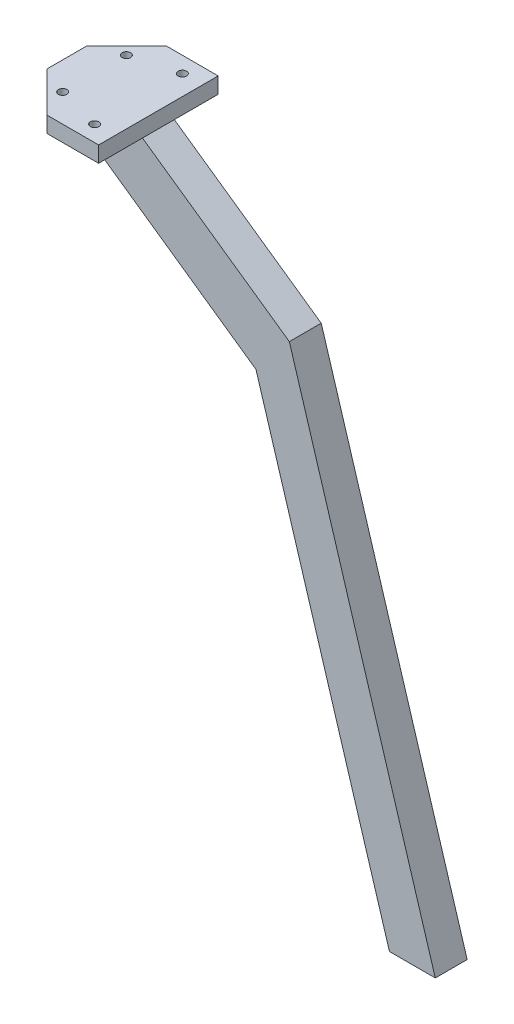
ISO-10303-21;
HEADER;
FILE_DESCRIPTION(('STEP AP214'),'2;1');
FILE_NAME('part.step','',(''),(''),'','','');
FILE_SCHEMA(('AUTOMOTIVE_DESIGN { 1 0 10303 214 1 1 1 1 }'));
ENDSEC;
DATA;
#1=APPLICATION_CONTEXT('core data for automotive mechanical design processes');
#2=APPLICATION_PROTOCOL_DEFINITION('international standard','automotive_design',2000,#1);
#3=PRODUCT_CONTEXT('',#1,'mechanical');
#4=PRODUCT('Part','Part','',(#3));
#5=PRODUCT_RELATED_PRODUCT_CATEGORY('part','',(#4));
#6=PRODUCT_DEFINITION_FORMATION('','',#4);
#7=PRODUCT_DEFINITION_CONTEXT('part definition',#1,'design');
#8=PRODUCT_DEFINITION('design','',#6,#7);
#9=PRODUCT_DEFINITION_SHAPE('','',#8);
#10=(LENGTH_UNIT() NAMED_UNIT(*) SI_UNIT(.MILLI.,.METRE.));
#11=(NAMED_UNIT(*) PLANE_ANGLE_UNIT() SI_UNIT($,.RADIAN.));
#12=(NAMED_UNIT(*) SI_UNIT($,.STERADIAN.) SOLID_ANGLE_UNIT());
#13=UNCERTAINTY_MEASURE_WITH_UNIT(LENGTH_MEASURE(1.E-05),#10,'distance_accuracy_value','');
#14=(GEOMETRIC_REPRESENTATION_CONTEXT(3) GLOBAL_UNCERTAINTY_ASSIGNED_CONTEXT((#13)) GLOBAL_UNIT_ASSIGNED_CONTEXT((#10,
#11,#12)) REPRESENTATION_CONTEXT('',''));
#15=CARTESIAN_POINT('',(0.,0.,0.));
#16=DIRECTION('',(0.,0.,1.));
#17=DIRECTION('',(1.,0.,0.));
#18=AXIS2_PLACEMENT_3D('',#15,#16,#17);
#19=CARTESIAN_POINT('',(0.,0.,0.));
#20=DIRECTION('',(0.,-1.,0.));
#21=DIRECTION('',(0.,0.,-1.));
#22=AXIS2_PLACEMENT_3D('',#19,#20,#21);
#23=PLANE('',#22);
#24=CARTESIAN_POINT('',(6.96945989785264,0.,-23.));
#25=DIRECTION('',(0.,1.,0.));
#26=DIRECTION('',(0.,0.,1.));
#27=AXIS2_PLACEMENT_3D('',#24,#25,#26);
#28=CIRCLE('',#27,1.06398593230415);
#29=CARTESIAN_POINT('',(6.96945989785264,0.,-21.9360140676959));
#30=VERTEX_POINT('',#29);
#31=EDGE_CURVE('E185',#30,#30,#28,.T.);
#32=ORIENTED_EDGE('',*,*,#31,.T.);
#33=EDGE_LOOP('',(#32));
#34=FACE_BOUND('',#33,.T.);
#35=CARTESIAN_POINT('',(18.,0.,-26.));
#36=DIRECTION('',(0.,1.,0.));
#37=DIRECTION('',(0.,0.,1.));
#38=AXIS2_PLACEMENT_3D('',#35,#36,#37);
#39=CIRCLE('',#38,1.06398593230415);
#40=CARTESIAN_POINT('',(18.,0.,-24.9360140676959));
#41=VERTEX_POINT('',#40);
#42=EDGE_CURVE('E184',#41,#41,#39,.T.);
#43=ORIENTED_EDGE('',*,*,#42,.T.);
#44=EDGE_LOOP('',(#43));
#45=FACE_BOUND('',#44,.T.);
#46=DIRECTION('',(0.,0.,-1.));
#47=VECTOR('',#46,1.);
#48=CARTESIAN_POINT('',(23.,0.,0.));
#49=LINE('',#48,#47);
#50=CARTESIAN_POINT('',(23.,0.,-19.));
#51=VERTEX_POINT('',#50);
#52=CARTESIAN_POINT('',(23.,0.,-30.));
#53=VERTEX_POINT('',#52);
#54=EDGE_CURVE('E142',#51,#53,#49,.T.);
#55=ORIENTED_EDGE('',*,*,#54,.F.);
#56=DIRECTION('',(-1.,0.,0.));
#57=VECTOR('',#56,1.);
#58=CARTESIAN_POINT('',(0.,0.,-19.));
#59=LINE('',#58,#57);
#60=CARTESIAN_POINT('',(0.,0.,-19.));
#61=VERTEX_POINT('',#60);
#62=EDGE_CURVE('E163',#51,#61,#59,.T.);
#63=ORIENTED_EDGE('',*,*,#62,.T.);
#64=DIRECTION('',(0.,0.,1.));
#65=VECTOR('',#64,1.);
#66=CARTESIAN_POINT('',(0.,0.,-10.));
#67=LINE('',#66,#65);
#68=CARTESIAN_POINT('',(0.,0.,-20.));
#69=VERTEX_POINT('',#68);
#70=EDGE_CURVE('E146',#69,#61,#67,.T.);
#71=ORIENTED_EDGE('',*,*,#70,.F.);
#72=DIRECTION('',(-0.707106781186547,0.,0.707106781186548));
#73=VECTOR('',#72,1.);
#74=CARTESIAN_POINT('',(0.,0.,-20.));
#75=LINE('',#74,#73);
#76=CARTESIAN_POINT('',(10.,0.,-30.));
#77=VERTEX_POINT('',#76);
#78=EDGE_CURVE('E144',#77,#69,#75,.T.);
#79=ORIENTED_EDGE('',*,*,#78,.F.);
#80=DIRECTION('',(-1.,0.,0.));
#81=VECTOR('',#80,1.);
#82=CARTESIAN_POINT('',(10.,0.,-30.));
#83=LINE('',#82,#81);
#84=EDGE_CURVE('E141',#53,#77,#83,.T.);
#85=ORIENTED_EDGE('',*,*,#84,.F.);
#86=EDGE_LOOP('',(#55,#63,#71,#79,#85));
#87=FACE_BOUND('',#86,.T.);
#88=ADVANCED_FACE('F39',(#34,#45,#87),#23,.T.);
#89=CARTESIAN_POINT('',(0.,4.,0.));
#90=DIRECTION('',(0.,-1.,0.));
#91=DIRECTION('',(0.,0.,-1.));
#92=AXIS2_PLACEMENT_3D('',#89,#90,#91);
#93=PLANE('',#92);
#94=DIRECTION('',(0.,0.,-1.));
#95=VECTOR('',#94,1.);
#96=CARTESIAN_POINT('',(23.,4.,0.));
#97=LINE('',#96,#95);
#98=CARTESIAN_POINT('',(23.,4.,0.));
#99=VERTEX_POINT('',#98);
#100=CARTESIAN_POINT('',(23.,4.,-30.));
#101=VERTEX_POINT('',#100);
#102=EDGE_CURVE('E151',#99,#101,#97,.T.);
#103=ORIENTED_EDGE('',*,*,#102,.T.);
#104=DIRECTION('',(-1.,0.,0.));
#105=VECTOR('',#104,1.);
#106=CARTESIAN_POINT('',(10.,4.,-30.));
#107=LINE('',#106,#105);
#108=CARTESIAN_POINT('',(10.,4.,-30.));
#109=VERTEX_POINT('',#108);
#110=EDGE_CURVE('E98',#101,#109,#107,.T.);
#111=ORIENTED_EDGE('',*,*,#110,.T.);
#112=DIRECTION('',(-0.707106781186547,0.,0.707106781186548));
#113=VECTOR('',#112,1.);
#114=CARTESIAN_POINT('',(0.,4.,-20.));
#115=LINE('',#114,#113);
#116=CARTESIAN_POINT('',(0.,4.,-20.));
#117=VERTEX_POINT('',#116);
#118=EDGE_CURVE('E115',#109,#117,#115,.T.);
#119=ORIENTED_EDGE('',*,*,#118,.T.);
#120=DIRECTION('',(0.,0.,1.));
#121=VECTOR('',#120,1.);
#122=CARTESIAN_POINT('',(0.,4.,-10.));
#123=LINE('',#122,#121);
#124=CARTESIAN_POINT('',(0.,4.,-10.));
#125=VERTEX_POINT('',#124);
#126=EDGE_CURVE('E107',#117,#125,#123,.T.);
#127=ORIENTED_EDGE('',*,*,#126,.T.);
#128=DIRECTION('',(0.707106781186548,0.,0.707106781186547));
#129=VECTOR('',#128,1.);
#130=CARTESIAN_POINT('',(10.,4.,0.));
#131=LINE('',#130,#129);
#132=CARTESIAN_POINT('',(10.,4.,0.));
#133=VERTEX_POINT('',#132);
#134=EDGE_CURVE('E112',#125,#133,#131,.T.);
#135=ORIENTED_EDGE('',*,*,#134,.T.);
#136=DIRECTION('',(1.,0.,0.));
#137=VECTOR('',#136,1.);
#138=CARTESIAN_POINT('',(10.,4.,0.));
#139=LINE('',#138,#137);
#140=EDGE_CURVE('E63',#133,#99,#139,.T.);
#141=ORIENTED_EDGE('',*,*,#140,.T.);
#142=EDGE_LOOP('',(#103,#111,#119,#127,#135,#141));
#143=FACE_BOUND('',#142,.T.);
#144=CARTESIAN_POINT('',(6.96945989785264,4.,-7.));
#145=DIRECTION('',(0.,1.,0.));
#146=DIRECTION('',(0.,0.,1.));
#147=AXIS2_PLACEMENT_3D('',#144,#145,#146);
#148=CIRCLE('',#147,1.06398593230415);
#149=CARTESIAN_POINT('',(6.96945989785264,4.,-5.93601406769585));
#150=VERTEX_POINT('',#149);
#151=EDGE_CURVE('E201',#150,#150,#148,.T.);
#152=ORIENTED_EDGE('',*,*,#151,.F.);
#153=EDGE_LOOP('',(#152));
#154=FACE_BOUND('',#153,.T.);
#155=CARTESIAN_POINT('',(18.,4.,-4.));
#156=DIRECTION('',(0.,1.,0.));
#157=DIRECTION('',(0.,0.,1.));
#158=AXIS2_PLACEMENT_3D('',#155,#156,#157);
#159=CIRCLE('',#158,1.06398593230415);
#160=CARTESIAN_POINT('',(18.,4.,-2.93601406769585));
#161=VERTEX_POINT('',#160);
#162=EDGE_CURVE('E195',#161,#161,#159,.T.);
#163=ORIENTED_EDGE('',*,*,#162,.F.);
#164=EDGE_LOOP('',(#163));
#165=FACE_BOUND('',#164,.T.);
#166=CARTESIAN_POINT('',(18.,4.,-26.));
#167=DIRECTION('',(0.,1.,0.));
#168=DIRECTION('',(0.,0.,1.));
#169=AXIS2_PLACEMENT_3D('',#166,#167,#168);
#170=CIRCLE('',#169,1.06398593230415);
#171=CARTESIAN_POINT('',(18.,4.,-24.9360140676959));
#172=VERTEX_POINT('',#171);
#173=EDGE_CURVE('E189',#172,#172,#170,.T.);
#174=ORIENTED_EDGE('',*,*,#173,.F.);
#175=EDGE_LOOP('',(#174));
#176=FACE_BOUND('',#175,.T.);
#177=CARTESIAN_POINT('',(6.96945989785264,4.,-23.));
#178=DIRECTION('',(0.,1.,0.));
#179=DIRECTION('',(0.,0.,1.));
#180=AXIS2_PLACEMENT_3D('',#177,#178,#179);
#181=CIRCLE('',#180,1.06398593230415);
#182=CARTESIAN_POINT('',(6.96945989785264,4.,-21.9360140676959));
#183=VERTEX_POINT('',#182);
#184=EDGE_CURVE('E181',#183,#183,#181,.T.);
#185=ORIENTED_EDGE('',*,*,#184,.F.);
#186=EDGE_LOOP('',(#185));
#187=FACE_BOUND('',#186,.T.);
#188=ADVANCED_FACE('F109',(#143,#154,#165,#176,#187),#93,.F.);
#189=DIRECTION('',(-1.,0.,0.));
#190=VECTOR('',#189,1.);
#191=CARTESIAN_POINT('',(0.,0.,-11.));
#192=LINE('',#191,#190);
#193=CARTESIAN_POINT('',(23.,0.,-11.));
#194=VERTEX_POINT('',#193);
#195=CARTESIAN_POINT('',(0.,0.,-11.));
#196=VERTEX_POINT('',#195);
#197=EDGE_CURVE('E237',#194,#196,#192,.T.);
#198=ORIENTED_EDGE('',*,*,#197,.F.);
#199=CARTESIAN_POINT('',(23.,0.,0.));
#200=VERTEX_POINT('',#199);
#201=EDGE_CURVE('E138',#200,#194,#49,.T.);
#202=ORIENTED_EDGE('',*,*,#201,.F.);
#203=DIRECTION('',(1.,0.,0.));
#204=VECTOR('',#203,1.);
#205=CARTESIAN_POINT('',(10.,0.,0.));
#206=LINE('',#205,#204);
#207=CARTESIAN_POINT('',(10.,0.,0.));
#208=VERTEX_POINT('',#207);
#209=EDGE_CURVE('E90',#208,#200,#206,.T.);
#210=ORIENTED_EDGE('',*,*,#209,.F.);
#211=DIRECTION('',(0.707106781186548,0.,0.707106781186547));
#212=VECTOR('',#211,1.);
#213=CARTESIAN_POINT('',(10.,0.,0.));
#214=LINE('',#213,#212);
#215=CARTESIAN_POINT('',(0.,0.,-10.));
#216=VERTEX_POINT('',#215);
#217=EDGE_CURVE('E148',#216,#208,#214,.T.);
#218=ORIENTED_EDGE('',*,*,#217,.F.);
#219=EDGE_CURVE('E126',#196,#216,#67,.T.);
#220=ORIENTED_EDGE('',*,*,#219,.F.);
#221=EDGE_LOOP('',(#198,#202,#210,#218,#220));
#222=FACE_BOUND('',#221,.T.);
#223=CARTESIAN_POINT('',(6.96945989785264,0.,-7.));
#224=DIRECTION('',(0.,1.,0.));
#225=DIRECTION('',(0.,0.,1.));
#226=AXIS2_PLACEMENT_3D('',#223,#224,#225);
#227=CIRCLE('',#226,1.06398593230415);
#228=CARTESIAN_POINT('',(6.96945989785264,0.,-5.93601406769585));
#229=VERTEX_POINT('',#228);
#230=EDGE_CURVE('E198',#229,#229,#227,.T.);
#231=ORIENTED_EDGE('',*,*,#230,.T.);
#232=EDGE_LOOP('',(#231));
#233=FACE_BOUND('',#232,.T.);
#234=CARTESIAN_POINT('',(18.,0.,-4.));
#235=DIRECTION('',(0.,1.,0.));
#236=DIRECTION('',(0.,0.,1.));
#237=AXIS2_PLACEMENT_3D('',#234,#235,#236);
#238=CIRCLE('',#237,1.06398593230415);
#239=CARTESIAN_POINT('',(18.,0.,-2.93601406769585));
#240=VERTEX_POINT('',#239);
#241=EDGE_CURVE('E192',#240,#240,#238,.T.);
#242=ORIENTED_EDGE('',*,*,#241,.T.);
#243=EDGE_LOOP('',(#242));
#244=FACE_BOUND('',#243,.T.);
#245=ADVANCED_FACE('F218',(#222,#233,#244),#23,.T.);
#246=CARTESIAN_POINT('',(23.,4.,0.));
#247=DIRECTION('',(-1.,0.,0.));
#248=DIRECTION('',(0.,0.,1.));
#249=AXIS2_PLACEMENT_3D('',#246,#247,#248);
#250=PLANE('',#249);
#251=ORIENTED_EDGE('',*,*,#201,.T.);
#252=DIRECTION('',(0.,0.,1.));
#253=VECTOR('',#252,1.);
#254=CARTESIAN_POINT('',(23.,0.,-19.));
#255=LINE('',#254,#253);
#256=EDGE_CURVE('E188',#51,#194,#255,.T.);
#257=ORIENTED_EDGE('',*,*,#256,.F.);
#258=ORIENTED_EDGE('',*,*,#54,.T.);
#259=DIRECTION('',(0.,-1.,0.));
#260=VECTOR('',#259,1.);
#261=CARTESIAN_POINT('',(23.,4.,-30.));
#262=LINE('',#261,#260);
#263=EDGE_CURVE('E11',#101,#53,#262,.T.);
#264=ORIENTED_EDGE('',*,*,#263,.F.);
#265=ORIENTED_EDGE('',*,*,#102,.F.);
#266=DIRECTION('',(0.,-1.,0.));
#267=VECTOR('',#266,1.);
#268=CARTESIAN_POINT('',(23.,4.,0.));
#269=LINE('',#268,#267);
#270=EDGE_CURVE('E134',#99,#200,#269,.T.);
#271=ORIENTED_EDGE('',*,*,#270,.T.);
#272=EDGE_LOOP('',(#251,#257,#258,#264,#265,#271));
#273=FACE_BOUND('',#272,.T.);
#274=ADVANCED_FACE('F41',(#273),#250,.F.);
#275=CARTESIAN_POINT('',(10.,4.,-30.));
#276=DIRECTION('',(0.,0.,1.));
#277=DIRECTION('',(1.,0.,0.));
#278=AXIS2_PLACEMENT_3D('',#275,#276,#277);
#279=PLANE('',#278);
#280=ORIENTED_EDGE('',*,*,#84,.T.);
#281=DIRECTION('',(0.,-1.,0.));
#282=VECTOR('',#281,1.);
#283=CARTESIAN_POINT('',(10.,4.,-30.));
#284=LINE('',#283,#282);
#285=EDGE_CURVE('E47',#109,#77,#284,.T.);
#286=ORIENTED_EDGE('',*,*,#285,.F.);
#287=ORIENTED_EDGE('',*,*,#110,.F.);
#288=ORIENTED_EDGE('',*,*,#263,.T.);
#289=EDGE_LOOP('',(#280,#286,#287,#288));
#290=FACE_BOUND('',#289,.T.);
#291=ADVANCED_FACE('F211',(#290),#279,.F.);
#292=CARTESIAN_POINT('',(0.,4.,-20.));
#293=DIRECTION('',(0.707106781186548,0.,0.707106781186547));
#294=DIRECTION('',(0.707106781186547,0.,-0.707106781186548));
#295=AXIS2_PLACEMENT_3D('',#292,#293,#294);
#296=PLANE('',#295);
#297=ORIENTED_EDGE('',*,*,#78,.T.);
#298=DIRECTION('',(0.,-1.,0.));
#299=VECTOR('',#298,1.);
#300=CARTESIAN_POINT('',(0.,4.,-20.));
#301=LINE('',#300,#299);
#302=EDGE_CURVE('E129',#117,#69,#301,.T.);
#303=ORIENTED_EDGE('',*,*,#302,.F.);
#304=ORIENTED_EDGE('',*,*,#118,.F.);
#305=ORIENTED_EDGE('',*,*,#285,.T.);
#306=EDGE_LOOP('',(#297,#303,#304,#305));
#307=FACE_BOUND('',#306,.T.);
#308=ADVANCED_FACE('F157',(#307),#296,.F.);
#309=CARTESIAN_POINT('',(0.,4.,-10.));
#310=DIRECTION('',(1.,0.,0.));
#311=DIRECTION('',(0.,0.,-1.));
#312=AXIS2_PLACEMENT_3D('',#309,#310,#311);
#313=PLANE('',#312);
#314=ORIENTED_EDGE('',*,*,#70,.T.);
#315=DIRECTION('',(0.,0.,1.));
#316=VECTOR('',#315,1.);
#317=CARTESIAN_POINT('',(0.,0.,-19.));
#318=LINE('',#317,#316);
#319=EDGE_CURVE('E165',#61,#196,#318,.T.);
#320=ORIENTED_EDGE('',*,*,#319,.T.);
#321=ORIENTED_EDGE('',*,*,#219,.T.);
#322=DIRECTION('',(0.,-1.,0.));
#323=VECTOR('',#322,1.);
#324=CARTESIAN_POINT('',(0.,4.,-10.));
#325=LINE('',#324,#323);
#326=EDGE_CURVE('E121',#125,#216,#325,.T.);
#327=ORIENTED_EDGE('',*,*,#326,.F.);
#328=ORIENTED_EDGE('',*,*,#126,.F.);
#329=ORIENTED_EDGE('',*,*,#302,.T.);
#330=EDGE_LOOP('',(#314,#320,#321,#327,#328,#329));
#331=FACE_BOUND('',#330,.T.);
#332=ADVANCED_FACE('F123',(#331),#313,.F.);
#333=CARTESIAN_POINT('',(10.,4.,0.));
#334=DIRECTION('',(0.707106781186547,0.,-0.707106781186548));
#335=DIRECTION('',(-0.707106781186548,0.,-0.707106781186547));
#336=AXIS2_PLACEMENT_3D('',#333,#334,#335);
#337=PLANE('',#336);
#338=ORIENTED_EDGE('',*,*,#217,.T.);
#339=DIRECTION('',(0.,-1.,0.));
#340=VECTOR('',#339,1.);
#341=CARTESIAN_POINT('',(10.,4.,0.));
#342=LINE('',#341,#340);
#343=EDGE_CURVE('E130',#133,#208,#342,.T.);
#344=ORIENTED_EDGE('',*,*,#343,.F.);
#345=ORIENTED_EDGE('',*,*,#134,.F.);
#346=ORIENTED_EDGE('',*,*,#326,.T.);
#347=EDGE_LOOP('',(#338,#344,#345,#346));
#348=FACE_BOUND('',#347,.T.);
#349=ADVANCED_FACE('F132',(#348),#337,.F.);
#350=CARTESIAN_POINT('',(10.,4.,0.));
#351=DIRECTION('',(0.,0.,-1.));
#352=DIRECTION('',(-1.,0.,0.));
#353=AXIS2_PLACEMENT_3D('',#350,#351,#352);
#354=PLANE('',#353);
#355=ORIENTED_EDGE('',*,*,#209,.T.);
#356=ORIENTED_EDGE('',*,*,#270,.F.);
#357=ORIENTED_EDGE('',*,*,#140,.F.);
#358=ORIENTED_EDGE('',*,*,#343,.T.);
#359=EDGE_LOOP('',(#355,#356,#357,#358));
#360=FACE_BOUND('',#359,.T.);
#361=ADVANCED_FACE('F255',(#360),#354,.F.);
#362=CARTESIAN_POINT('',(6.96945989785264,4.,-7.));
#363=DIRECTION('',(0.,-1.,0.));
#364=DIRECTION('',(0.,0.,-1.));
#365=AXIS2_PLACEMENT_3D('',#362,#363,#364);
#366=CYLINDRICAL_SURFACE('',#365,1.06398593230415);
#367=ORIENTED_EDGE('',*,*,#151,.T.);
#368=EDGE_LOOP('',(#367));
#369=FACE_BOUND('',#368,.T.);
#370=ORIENTED_EDGE('',*,*,#230,.F.);
#371=EDGE_LOOP('',(#370));
#372=FACE_BOUND('',#371,.T.);
#373=ADVANCED_FACE('F245',(#369,#372),#366,.F.);
#374=CARTESIAN_POINT('',(18.,4.,-4.));
#375=DIRECTION('',(0.,-1.,0.));
#376=DIRECTION('',(0.,0.,-1.));
#377=AXIS2_PLACEMENT_3D('',#374,#375,#376);
#378=CYLINDRICAL_SURFACE('',#377,1.06398593230415);
#379=ORIENTED_EDGE('',*,*,#162,.T.);
#380=EDGE_LOOP('',(#379));
#381=FACE_BOUND('',#380,.T.);
#382=ORIENTED_EDGE('',*,*,#241,.F.);
#383=EDGE_LOOP('',(#382));
#384=FACE_BOUND('',#383,.T.);
#385=ADVANCED_FACE('F242',(#381,#384),#378,.F.);
#386=CARTESIAN_POINT('',(18.,4.,-26.));
#387=DIRECTION('',(0.,-1.,0.));
#388=DIRECTION('',(0.,0.,-1.));
#389=AXIS2_PLACEMENT_3D('',#386,#387,#388);
#390=CYLINDRICAL_SURFACE('',#389,1.06398593230415);
#391=ORIENTED_EDGE('',*,*,#173,.T.);
#392=EDGE_LOOP('',(#391));
#393=FACE_BOUND('',#392,.T.);
#394=ORIENTED_EDGE('',*,*,#42,.F.);
#395=EDGE_LOOP('',(#394));
#396=FACE_BOUND('',#395,.T.);
#397=ADVANCED_FACE('F244',(#393,#396),#390,.F.);
#398=CARTESIAN_POINT('',(6.96945989785264,4.,-23.));
#399=DIRECTION('',(0.,-1.,0.));
#400=DIRECTION('',(0.,0.,-1.));
#401=AXIS2_PLACEMENT_3D('',#398,#399,#400);
#402=CYLINDRICAL_SURFACE('',#401,1.06398593230415);
#403=ORIENTED_EDGE('',*,*,#184,.T.);
#404=EDGE_LOOP('',(#403));
#405=FACE_BOUND('',#404,.T.);
#406=ORIENTED_EDGE('',*,*,#31,.F.);
#407=EDGE_LOOP('',(#406));
#408=FACE_BOUND('',#407,.T.);
#409=ADVANCED_FACE('F252',(#405,#408),#402,.F.);
#410=CARTESIAN_POINT('',(59.8618419930048,-25.8109396357969,-19.));
#411=DIRECTION('',(0.573576436351041,0.819152044288995,0.));
#412=DIRECTION('',(-0.819152044288995,0.573576436351041,0.));
#413=AXIS2_PLACEMENT_3D('',#410,#411,#412);
#414=PLANE('',#413);
#415=ORIENTED_EDGE('',*,*,#256,.T.);
#416=DIRECTION('',(-0.819152044288995,0.573576436351041,0.));
#417=VECTOR('',#416,1.);
#418=CARTESIAN_POINT('',(59.8618419930048,-25.8109396357969,-11.));
#419=LINE('',#418,#417);
#420=CARTESIAN_POINT('',(59.8618419930048,-25.8109396357969,-11.));
#421=VERTEX_POINT('',#420);
#422=EDGE_CURVE('E296',#421,#194,#419,.T.);
#423=ORIENTED_EDGE('',*,*,#422,.F.);
#424=DIRECTION('',(0.,0.,1.));
#425=VECTOR('',#424,1.);
#426=CARTESIAN_POINT('',(59.8618419930048,-25.8109396357969,-19.));
#427=LINE('',#426,#425);
#428=CARTESIAN_POINT('',(59.8618419930048,-25.8109396357969,-19.));
#429=VERTEX_POINT('',#428);
#430=EDGE_CURVE('E316',#429,#421,#427,.T.);
#431=ORIENTED_EDGE('',*,*,#430,.F.);
#432=DIRECTION('',(-0.819152044288995,0.573576436351041,0.));
#433=VECTOR('',#432,1.);
#434=CARTESIAN_POINT('',(59.8618419930048,-25.8109396357969,-19.));
#435=LINE('',#434,#433);
#436=EDGE_CURVE('E171',#429,#51,#435,.T.);
#437=ORIENTED_EDGE('',*,*,#436,.T.);
#438=EDGE_LOOP('',(#415,#423,#431,#437));
#439=FACE_BOUND('',#438,.T.);
#440=ADVANCED_FACE('F261',(#439),#414,.T.);
#441=CARTESIAN_POINT('',(96.4862455768699,-145.810939635797,-19.));
#442=DIRECTION('',(0.956445659555141,0.291910432013196,0.));
#443=DIRECTION('',(-0.291910432013196,0.956445659555141,0.));
#444=AXIS2_PLACEMENT_3D('',#441,#442,#443);
#445=PLANE('',#444);
#446=ORIENTED_EDGE('',*,*,#430,.T.);
#447=DIRECTION('',(-0.291910432013196,0.956445659555141,0.));
#448=VECTOR('',#447,1.);
#449=CARTESIAN_POINT('',(96.4862455768699,-145.810939635797,-11.));
#450=LINE('',#449,#448);
#451=CARTESIAN_POINT('',(96.4862455768699,-145.810939635797,-11.));
#452=VERTEX_POINT('',#451);
#453=EDGE_CURVE('E323',#452,#421,#450,.T.);
#454=ORIENTED_EDGE('',*,*,#453,.F.);
#455=DIRECTION('',(0.,0.,1.));
#456=VECTOR('',#455,1.);
#457=CARTESIAN_POINT('',(96.4862455768699,-145.810939635797,-19.));
#458=LINE('',#457,#456);
#459=CARTESIAN_POINT('',(96.4862455768699,-145.810939635797,-19.));
#460=VERTEX_POINT('',#459);
#461=EDGE_CURVE('E335',#460,#452,#458,.T.);
#462=ORIENTED_EDGE('',*,*,#461,.F.);
#463=DIRECTION('',(-0.291910432013196,0.956445659555141,0.));
#464=VECTOR('',#463,1.);
#465=CARTESIAN_POINT('',(96.4862455768699,-145.810939635797,-19.));
#466=LINE('',#465,#464);
#467=EDGE_CURVE('E177',#460,#429,#466,.T.);
#468=ORIENTED_EDGE('',*,*,#467,.T.);
#469=EDGE_LOOP('',(#446,#454,#462,#468));
#470=FACE_BOUND('',#469,.T.);
#471=ADVANCED_FACE('F274',(#470),#445,.T.);
#472=CARTESIAN_POINT('',(84.9853308201274,-145.810939635797,-19.));
#473=DIRECTION('',(0.,-1.,0.));
#474=DIRECTION('',(0.,0.,-1.));
#475=AXIS2_PLACEMENT_3D('',#472,#473,#474);
#476=PLANE('',#475);
#477=ORIENTED_EDGE('',*,*,#461,.T.);
#478=DIRECTION('',(1.,0.,0.));
#479=VECTOR('',#478,1.);
#480=CARTESIAN_POINT('',(84.9853308201274,-145.810939635797,-11.));
#481=LINE('',#480,#479);
#482=CARTESIAN_POINT('',(84.9853308201274,-145.810939635797,-11.));
#483=VERTEX_POINT('',#482);
#484=EDGE_CURVE('E344',#483,#452,#481,.T.);
#485=ORIENTED_EDGE('',*,*,#484,.F.);
#486=DIRECTION('',(0.,0.,1.));
#487=VECTOR('',#486,1.);
#488=CARTESIAN_POINT('',(84.9853308201274,-145.810939635797,-19.));
#489=LINE('',#488,#487);
#490=CARTESIAN_POINT('',(84.9853308201274,-145.810939635797,-19.));
#491=VERTEX_POINT('',#490);
#492=EDGE_CURVE('E174',#491,#483,#489,.T.);
#493=ORIENTED_EDGE('',*,*,#492,.F.);
#494=DIRECTION('',(1.,0.,0.));
#495=VECTOR('',#494,1.);
#496=CARTESIAN_POINT('',(84.9853308201274,-145.810939635797,-19.));
#497=LINE('',#496,#495);
#498=EDGE_CURVE('E329',#491,#460,#497,.T.);
#499=ORIENTED_EDGE('',*,*,#498,.T.);
#500=EDGE_LOOP('',(#477,#485,#493,#499));
#501=FACE_BOUND('',#500,.T.);
#502=ADVANCED_FACE('F270',(#501),#476,.T.);
#503=CARTESIAN_POINT('',(51.4862455768699,-36.0510572670402,-19.));
#504=DIRECTION('',(-0.956445659555141,-0.291910432013196,0.));
#505=DIRECTION('',(0.291910432013196,-0.956445659555141,0.));
#506=AXIS2_PLACEMENT_3D('',#503,#504,#505);
#507=PLANE('',#506);
#508=ORIENTED_EDGE('',*,*,#492,.T.);
#509=DIRECTION('',(0.291910432013196,-0.956445659555141,0.));
#510=VECTOR('',#509,1.);
#511=CARTESIAN_POINT('',(51.4862455768699,-36.0510572670402,-11.));
#512=LINE('',#511,#510);
#513=CARTESIAN_POINT('',(51.4862455768699,-36.0510572670402,-11.));
#514=VERTEX_POINT('',#513);
#515=EDGE_CURVE('E339',#514,#483,#512,.T.);
#516=ORIENTED_EDGE('',*,*,#515,.F.);
#517=DIRECTION('',(0.,0.,1.));
#518=VECTOR('',#517,1.);
#519=CARTESIAN_POINT('',(51.4862455768699,-36.0510572670402,-19.));
#520=LINE('',#519,#518);
#521=CARTESIAN_POINT('',(51.4862455768699,-36.0510572670402,-19.));
#522=VERTEX_POINT('',#521);
#523=EDGE_CURVE('E170',#522,#514,#520,.T.);
#524=ORIENTED_EDGE('',*,*,#523,.F.);
#525=DIRECTION('',(0.291910432013196,-0.956445659555141,0.));
#526=VECTOR('',#525,1.);
#527=CARTESIAN_POINT('',(51.4862455768699,-36.0510572670402,-19.));
#528=LINE('',#527,#526);
#529=EDGE_CURVE('E321',#522,#491,#528,.T.);
#530=ORIENTED_EDGE('',*,*,#529,.T.);
#531=EDGE_LOOP('',(#508,#516,#524,#530));
#532=FACE_BOUND('',#531,.T.);
#533=ADVANCED_FACE('F267',(#532),#507,.T.);
#534=CARTESIAN_POINT('',(0.,0.,-19.));
#535=DIRECTION('',(-0.573576436351042,-0.819152044288995,0.));
#536=DIRECTION('',(0.819152044288995,-0.573576436351042,0.));
#537=AXIS2_PLACEMENT_3D('',#534,#535,#536);
#538=PLANE('',#537);
#539=ORIENTED_EDGE('',*,*,#523,.T.);
#540=DIRECTION('',(0.819152044288995,-0.573576436351042,0.));
#541=VECTOR('',#540,1.);
#542=CARTESIAN_POINT('',(0.,0.,-11.));
#543=LINE('',#542,#541);
#544=EDGE_CURVE('E292',#196,#514,#543,.T.);
#545=ORIENTED_EDGE('',*,*,#544,.F.);
#546=ORIENTED_EDGE('',*,*,#319,.F.);
#547=DIRECTION('',(0.819152044288995,-0.573576436351042,0.));
#548=VECTOR('',#547,1.);
#549=CARTESIAN_POINT('',(0.,0.,-19.));
#550=LINE('',#549,#548);
#551=EDGE_CURVE('E54',#61,#522,#550,.T.);
#552=ORIENTED_EDGE('',*,*,#551,.T.);
#553=EDGE_LOOP('',(#539,#545,#546,#552));
#554=FACE_BOUND('',#553,.T.);
#555=ADVANCED_FACE('F263',(#554),#538,.T.);
#556=CARTESIAN_POINT('',(0.,0.,-19.));
#557=DIRECTION('',(0.,0.,1.));
#558=DIRECTION('',(1.,0.,0.));
#559=AXIS2_PLACEMENT_3D('',#556,#557,#558);
#560=PLANE('',#559);
#561=ORIENTED_EDGE('',*,*,#62,.F.);
#562=ORIENTED_EDGE('',*,*,#436,.F.);
#563=ORIENTED_EDGE('',*,*,#467,.F.);
#564=ORIENTED_EDGE('',*,*,#498,.F.);
#565=ORIENTED_EDGE('',*,*,#529,.F.);
#566=ORIENTED_EDGE('',*,*,#551,.F.);
#567=EDGE_LOOP('',(#561,#562,#563,#564,#565,#566));
#568=FACE_BOUND('',#567,.T.);
#569=ADVANCED_FACE('F266',(#568),#560,.F.);
#570=CARTESIAN_POINT('',(0.,0.,-11.));
#571=DIRECTION('',(0.,0.,1.));
#572=DIRECTION('',(1.,0.,0.));
#573=AXIS2_PLACEMENT_3D('',#570,#571,#572);
#574=PLANE('',#573);
#575=ORIENTED_EDGE('',*,*,#197,.T.);
#576=ORIENTED_EDGE('',*,*,#544,.T.);
#577=ORIENTED_EDGE('',*,*,#515,.T.);
#578=ORIENTED_EDGE('',*,*,#484,.T.);
#579=ORIENTED_EDGE('',*,*,#453,.T.);
#580=ORIENTED_EDGE('',*,*,#422,.T.);
#581=EDGE_LOOP('',(#575,#576,#577,#578,#579,#580));
#582=FACE_BOUND('',#581,.T.);
#583=ADVANCED_FACE('F284',(#582),#574,.T.);
#584=CLOSED_SHELL('',(#88,#188,#245,#274,#291,#308,#332,#349,#361,#373,#385,#397,#409,#440,#471,
#502,#533,#555,#569,#583));
#585=MANIFOLD_SOLID_BREP('B2',#584);
#586=ADVANCED_BREP_SHAPE_REPRESENTATION('',(#18,#585),#14);
#587=SHAPE_DEFINITION_REPRESENTATION(#9,#586);
ENDSEC;
END-ISO-10303-21;
